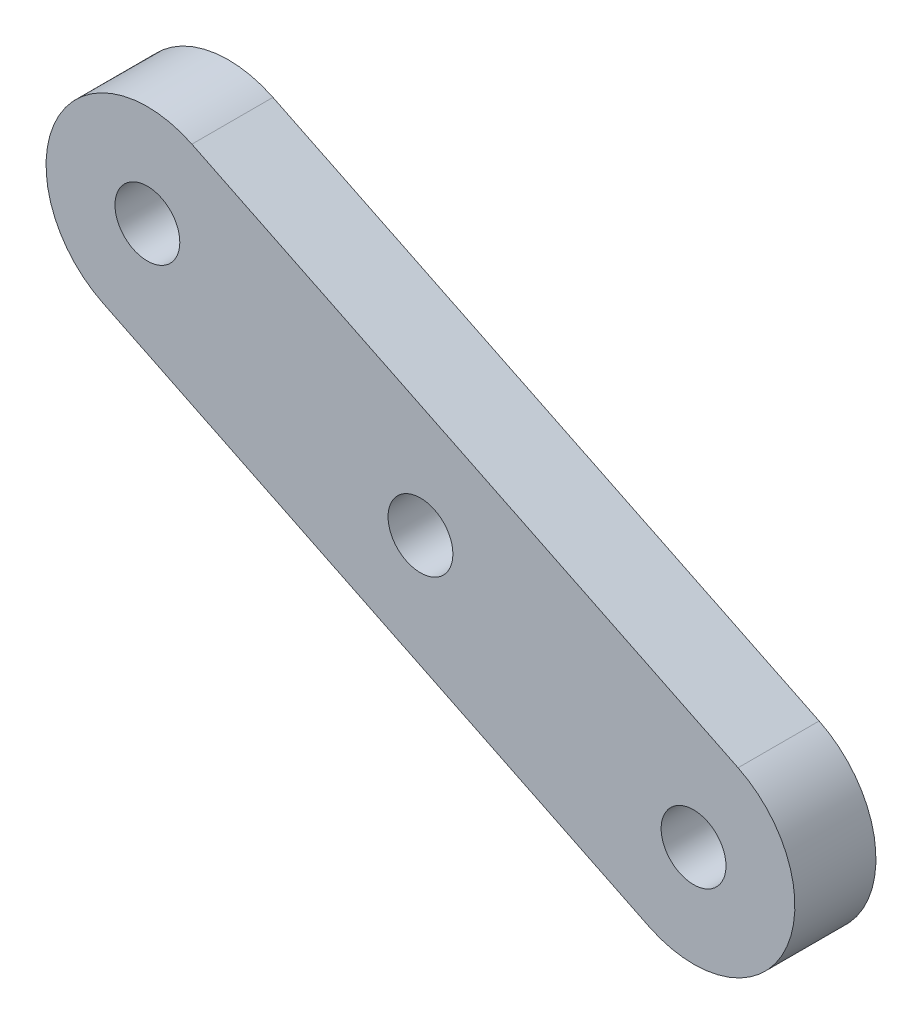
ISO-10303-21;
HEADER;
FILE_DESCRIPTION(('STEP AP214'),'2;1');
FILE_NAME('part.step','',(''),(''),'','','');
FILE_SCHEMA(('AUTOMOTIVE_DESIGN { 1 0 10303 214 1 1 1 1 }'));
ENDSEC;
DATA;
#1=APPLICATION_CONTEXT('core data for automotive mechanical design processes');
#2=APPLICATION_PROTOCOL_DEFINITION('international standard','automotive_design',2000,#1);
#3=PRODUCT_CONTEXT('',#1,'mechanical');
#4=PRODUCT('Part','Part','',(#3));
#5=PRODUCT_RELATED_PRODUCT_CATEGORY('part','',(#4));
#6=PRODUCT_DEFINITION_FORMATION('','',#4);
#7=PRODUCT_DEFINITION_CONTEXT('part definition',#1,'design');
#8=PRODUCT_DEFINITION('design','',#6,#7);
#9=PRODUCT_DEFINITION_SHAPE('','',#8);
#10=(LENGTH_UNIT() NAMED_UNIT(*) SI_UNIT(.MILLI.,.METRE.));
#11=(NAMED_UNIT(*) PLANE_ANGLE_UNIT() SI_UNIT($,.RADIAN.));
#12=(NAMED_UNIT(*) SI_UNIT($,.STERADIAN.) SOLID_ANGLE_UNIT());
#13=UNCERTAINTY_MEASURE_WITH_UNIT(LENGTH_MEASURE(1.E-05),#10,'distance_accuracy_value','');
#14=(GEOMETRIC_REPRESENTATION_CONTEXT(3) GLOBAL_UNCERTAINTY_ASSIGNED_CONTEXT((#13)) GLOBAL_UNIT_ASSIGNED_CONTEXT((#10,
#11,#12)) REPRESENTATION_CONTEXT('',''));
#15=CARTESIAN_POINT('',(0.,0.,0.));
#16=DIRECTION('',(0.,0.,1.));
#17=DIRECTION('',(1.,0.,0.));
#18=AXIS2_PLACEMENT_3D('',#15,#16,#17);
#19=CARTESIAN_POINT('',(0.,0.,4.));
#20=DIRECTION('',(0.,0.,1.));
#21=DIRECTION('',(1.,0.,0.));
#22=AXIS2_PLACEMENT_3D('',#19,#20,#21);
#23=PLANE('',#22);
#24=CARTESIAN_POINT('',(0.,0.,4.));
#25=DIRECTION('',(0.,0.,1.));
#26=DIRECTION('',(1.,0.,0.));
#27=AXIS2_PLACEMENT_3D('',#24,#25,#26);
#28=CIRCLE('',#27,1.6);
#29=CARTESIAN_POINT('',(1.60000000000001,0.,4.));
#30=VERTEX_POINT('',#29);
#31=EDGE_CURVE('E116',#30,#30,#28,.T.);
#32=ORIENTED_EDGE('',*,*,#31,.F.);
#33=EDGE_LOOP('',(#32));
#34=FACE_BOUND('',#33,.T.);
#35=CARTESIAN_POINT('',(0.,0.,4.));
#36=DIRECTION('',(0.,0.,1.));
#37=DIRECTION('',(1.,0.,0.));
#38=AXIS2_PLACEMENT_3D('',#35,#36,#37);
#39=CIRCLE('',#38,5.);
#40=CARTESIAN_POINT('',(-2.19568936266241,-4.4920984208598,4.));
#41=VERTEX_POINT('',#40);
#42=CARTESIAN_POINT('',(2.19568936266242,4.4920984208598,4.));
#43=VERTEX_POINT('',#42);
#44=EDGE_CURVE('E86',#41,#43,#39,.T.);
#45=ORIENTED_EDGE('',*,*,#44,.T.);
#46=DIRECTION('',(-0.89841968417196,0.439137872532483,0.));
#47=VECTOR('',#46,1.);
#48=CARTESIAN_POINT('',(2.19568936266242,4.4920984208598,4.));
#49=LINE('',#48,#47);
#50=CARTESIAN_POINT('',(-24.7569011624964,17.6662345968343,4.));
#51=VERTEX_POINT('',#50);
#52=EDGE_CURVE('E81',#43,#51,#49,.T.);
#53=ORIENTED_EDGE('',*,*,#52,.T.);
#54=CARTESIAN_POINT('',(-26.9525905251588,13.1741361759745,4.));
#55=DIRECTION('',(0.,0.,1.));
#56=DIRECTION('',(1.,0.,0.));
#57=AXIS2_PLACEMENT_3D('',#54,#55,#56);
#58=CIRCLE('',#57,5.);
#59=CARTESIAN_POINT('',(-29.1482798878212,8.68203775511468,4.));
#60=VERTEX_POINT('',#59);
#61=EDGE_CURVE('E84',#51,#60,#58,.T.);
#62=ORIENTED_EDGE('',*,*,#61,.T.);
#63=DIRECTION('',(0.89841968417196,-0.439137872532483,0.));
#64=VECTOR('',#63,1.);
#65=CARTESIAN_POINT('',(-2.19568936266241,-4.4920984208598,4.));
#66=LINE('',#65,#64);
#67=EDGE_CURVE('E51',#60,#41,#66,.T.);
#68=ORIENTED_EDGE('',*,*,#67,.T.);
#69=EDGE_LOOP('',(#45,#53,#62,#68));
#70=FACE_BOUND('',#69,.T.);
#71=CARTESIAN_POINT('',(-26.9525905251588,13.1741361759745,4.));
#72=DIRECTION('',(0.,0.,1.));
#73=DIRECTION('',(1.,0.,0.));
#74=AXIS2_PLACEMENT_3D('',#71,#72,#73);
#75=CIRCLE('',#74,1.6);
#76=CARTESIAN_POINT('',(-25.3525905251588,13.1741361759745,4.));
#77=VERTEX_POINT('',#76);
#78=EDGE_CURVE('E101',#77,#77,#75,.T.);
#79=ORIENTED_EDGE('',*,*,#78,.F.);
#80=EDGE_LOOP('',(#79));
#81=FACE_BOUND('',#80,.T.);
#82=CARTESIAN_POINT('',(-13.4762952625794,6.58706808798724,4.));
#83=DIRECTION('',(0.,0.,1.));
#84=DIRECTION('',(1.,0.,0.));
#85=AXIS2_PLACEMENT_3D('',#82,#83,#84);
#86=CIRCLE('',#85,1.6);
#87=CARTESIAN_POINT('',(-11.8762952625794,6.58706808798724,4.));
#88=VERTEX_POINT('',#87);
#89=EDGE_CURVE('E122',#88,#88,#86,.T.);
#90=ORIENTED_EDGE('',*,*,#89,.F.);
#91=EDGE_LOOP('',(#90));
#92=FACE_BOUND('',#91,.T.);
#93=ADVANCED_FACE('F34',(#34,#70,#81,#92),#23,.T.);
#94=CARTESIAN_POINT('',(0.,0.,0.));
#95=DIRECTION('',(0.,0.,1.));
#96=DIRECTION('',(1.,0.,0.));
#97=AXIS2_PLACEMENT_3D('',#94,#95,#96);
#98=PLANE('',#97);
#99=CARTESIAN_POINT('',(0.,0.,0.));
#100=DIRECTION('',(0.,0.,1.));
#101=DIRECTION('',(1.,0.,0.));
#102=AXIS2_PLACEMENT_3D('',#99,#100,#101);
#103=CIRCLE('',#102,5.);
#104=CARTESIAN_POINT('',(-2.19568936266241,-4.4920984208598,0.));
#105=VERTEX_POINT('',#104);
#106=CARTESIAN_POINT('',(2.19568936266242,4.4920984208598,0.));
#107=VERTEX_POINT('',#106);
#108=EDGE_CURVE('E98',#105,#107,#103,.T.);
#109=ORIENTED_EDGE('',*,*,#108,.F.);
#110=DIRECTION('',(0.89841968417196,-0.439137872532483,0.));
#111=VECTOR('',#110,1.);
#112=CARTESIAN_POINT('',(-2.19568936266241,-4.4920984208598,0.));
#113=LINE('',#112,#111);
#114=CARTESIAN_POINT('',(-29.1482798878212,8.68203775511468,0.));
#115=VERTEX_POINT('',#114);
#116=EDGE_CURVE('E74',#115,#105,#113,.T.);
#117=ORIENTED_EDGE('',*,*,#116,.F.);
#118=CARTESIAN_POINT('',(-26.9525905251588,13.1741361759745,0.));
#119=DIRECTION('',(0.,0.,1.));
#120=DIRECTION('',(1.,0.,0.));
#121=AXIS2_PLACEMENT_3D('',#118,#119,#120);
#122=CIRCLE('',#121,5.);
#123=CARTESIAN_POINT('',(-24.7569011624964,17.6662345968343,0.));
#124=VERTEX_POINT('',#123);
#125=EDGE_CURVE('E68',#124,#115,#122,.T.);
#126=ORIENTED_EDGE('',*,*,#125,.F.);
#127=DIRECTION('',(-0.89841968417196,0.439137872532483,0.));
#128=VECTOR('',#127,1.);
#129=CARTESIAN_POINT('',(2.19568936266242,4.4920984208598,0.));
#130=LINE('',#129,#128);
#131=EDGE_CURVE('E90',#107,#124,#130,.T.);
#132=ORIENTED_EDGE('',*,*,#131,.F.);
#133=EDGE_LOOP('',(#109,#117,#126,#132));
#134=FACE_BOUND('',#133,.T.);
#135=CARTESIAN_POINT('',(-26.9525905251588,13.1741361759745,0.));
#136=DIRECTION('',(0.,0.,1.));
#137=DIRECTION('',(1.,0.,0.));
#138=AXIS2_PLACEMENT_3D('',#135,#136,#137);
#139=CIRCLE('',#138,1.6);
#140=CARTESIAN_POINT('',(-25.3525905251588,13.1741361759745,0.));
#141=VERTEX_POINT('',#140);
#142=EDGE_CURVE('E113',#141,#141,#139,.T.);
#143=ORIENTED_EDGE('',*,*,#142,.T.);
#144=EDGE_LOOP('',(#143));
#145=FACE_BOUND('',#144,.T.);
#146=CARTESIAN_POINT('',(0.,0.,0.));
#147=DIRECTION('',(0.,0.,1.));
#148=DIRECTION('',(1.,0.,0.));
#149=AXIS2_PLACEMENT_3D('',#146,#147,#148);
#150=CIRCLE('',#149,1.6);
#151=CARTESIAN_POINT('',(1.60000000000001,0.,0.));
#152=VERTEX_POINT('',#151);
#153=EDGE_CURVE('E119',#152,#152,#150,.T.);
#154=ORIENTED_EDGE('',*,*,#153,.T.);
#155=EDGE_LOOP('',(#154));
#156=FACE_BOUND('',#155,.T.);
#157=CARTESIAN_POINT('',(-13.4762952625794,6.58706808798724,0.));
#158=DIRECTION('',(0.,0.,1.));
#159=DIRECTION('',(1.,0.,0.));
#160=AXIS2_PLACEMENT_3D('',#157,#158,#159);
#161=CIRCLE('',#160,1.6);
#162=CARTESIAN_POINT('',(-11.8762952625794,6.58706808798724,0.));
#163=VERTEX_POINT('',#162);
#164=EDGE_CURVE('E125',#163,#163,#161,.T.);
#165=ORIENTED_EDGE('',*,*,#164,.T.);
#166=EDGE_LOOP('',(#165));
#167=FACE_BOUND('',#166,.T.);
#168=ADVANCED_FACE('F109',(#134,#145,#156,#167),#98,.F.);
#169=CARTESIAN_POINT('',(0.,0.,4.));
#170=DIRECTION('',(0.,0.,-1.));
#171=DIRECTION('',(-1.,0.,0.));
#172=AXIS2_PLACEMENT_3D('',#169,#170,#171);
#173=CYLINDRICAL_SURFACE('',#172,5.);
#174=ORIENTED_EDGE('',*,*,#108,.T.);
#175=DIRECTION('',(0.,0.,-1.));
#176=VECTOR('',#175,1.);
#177=CARTESIAN_POINT('',(2.19568936266242,4.4920984208598,4.));
#178=LINE('',#177,#176);
#179=EDGE_CURVE('E11',#43,#107,#178,.T.);
#180=ORIENTED_EDGE('',*,*,#179,.F.);
#181=ORIENTED_EDGE('',*,*,#44,.F.);
#182=DIRECTION('',(0.,0.,-1.));
#183=VECTOR('',#182,1.);
#184=CARTESIAN_POINT('',(-2.19568936266241,-4.4920984208598,4.));
#185=LINE('',#184,#183);
#186=EDGE_CURVE('E94',#41,#105,#185,.T.);
#187=ORIENTED_EDGE('',*,*,#186,.T.);
#188=EDGE_LOOP('',(#174,#180,#181,#187));
#189=FACE_BOUND('',#188,.T.);
#190=ADVANCED_FACE('F36',(#189),#173,.T.);
#191=CARTESIAN_POINT('',(2.19568936266242,4.4920984208598,4.));
#192=DIRECTION('',(-0.439137872532483,-0.89841968417196,0.));
#193=DIRECTION('',(0.89841968417196,-0.439137872532483,0.));
#194=AXIS2_PLACEMENT_3D('',#191,#192,#193);
#195=PLANE('',#194);
#196=ORIENTED_EDGE('',*,*,#131,.T.);
#197=DIRECTION('',(0.,0.,-1.));
#198=VECTOR('',#197,1.);
#199=CARTESIAN_POINT('',(-24.7569011624964,17.6662345968343,4.));
#200=LINE('',#199,#198);
#201=EDGE_CURVE('E43',#51,#124,#200,.T.);
#202=ORIENTED_EDGE('',*,*,#201,.F.);
#203=ORIENTED_EDGE('',*,*,#52,.F.);
#204=ORIENTED_EDGE('',*,*,#179,.T.);
#205=EDGE_LOOP('',(#196,#202,#203,#204));
#206=FACE_BOUND('',#205,.T.);
#207=ADVANCED_FACE('F89',(#206),#195,.F.);
#208=CARTESIAN_POINT('',(-26.9525905251588,13.1741361759745,4.));
#209=DIRECTION('',(0.,0.,-1.));
#210=DIRECTION('',(-1.,0.,0.));
#211=AXIS2_PLACEMENT_3D('',#208,#209,#210);
#212=CYLINDRICAL_SURFACE('',#211,5.);
#213=ORIENTED_EDGE('',*,*,#125,.T.);
#214=DIRECTION('',(0.,0.,-1.));
#215=VECTOR('',#214,1.);
#216=CARTESIAN_POINT('',(-29.1482798878212,8.68203775511468,4.));
#217=LINE('',#216,#215);
#218=EDGE_CURVE('E91',#60,#115,#217,.T.);
#219=ORIENTED_EDGE('',*,*,#218,.F.);
#220=ORIENTED_EDGE('',*,*,#61,.F.);
#221=ORIENTED_EDGE('',*,*,#201,.T.);
#222=EDGE_LOOP('',(#213,#219,#220,#221));
#223=FACE_BOUND('',#222,.T.);
#224=ADVANCED_FACE('F92',(#223),#212,.T.);
#225=CARTESIAN_POINT('',(-2.19568936266241,-4.4920984208598,4.));
#226=DIRECTION('',(0.439137872532483,0.89841968417196,0.));
#227=DIRECTION('',(-0.89841968417196,0.439137872532483,0.));
#228=AXIS2_PLACEMENT_3D('',#225,#226,#227);
#229=PLANE('',#228);
#230=ORIENTED_EDGE('',*,*,#116,.T.);
#231=ORIENTED_EDGE('',*,*,#186,.F.);
#232=ORIENTED_EDGE('',*,*,#67,.F.);
#233=ORIENTED_EDGE('',*,*,#218,.T.);
#234=EDGE_LOOP('',(#230,#231,#232,#233));
#235=FACE_BOUND('',#234,.T.);
#236=ADVANCED_FACE('F106',(#235),#229,.F.);
#237=CARTESIAN_POINT('',(-26.9525905251588,13.1741361759745,4.));
#238=DIRECTION('',(0.,0.,-1.));
#239=DIRECTION('',(-1.,0.,0.));
#240=AXIS2_PLACEMENT_3D('',#237,#238,#239);
#241=CYLINDRICAL_SURFACE('',#240,1.6);
#242=ORIENTED_EDGE('',*,*,#78,.T.);
#243=EDGE_LOOP('',(#242));
#244=FACE_BOUND('',#243,.T.);
#245=ORIENTED_EDGE('',*,*,#142,.F.);
#246=EDGE_LOOP('',(#245));
#247=FACE_BOUND('',#246,.T.);
#248=ADVANCED_FACE('F143',(#244,#247),#241,.F.);
#249=CARTESIAN_POINT('',(0.,0.,4.));
#250=DIRECTION('',(0.,0.,-1.));
#251=DIRECTION('',(-1.,0.,0.));
#252=AXIS2_PLACEMENT_3D('',#249,#250,#251);
#253=CYLINDRICAL_SURFACE('',#252,1.6);
#254=ORIENTED_EDGE('',*,*,#31,.T.);
#255=EDGE_LOOP('',(#254));
#256=FACE_BOUND('',#255,.T.);
#257=ORIENTED_EDGE('',*,*,#153,.F.);
#258=EDGE_LOOP('',(#257));
#259=FACE_BOUND('',#258,.T.);
#260=ADVANCED_FACE('F189',(#256,#259),#253,.F.);
#261=CARTESIAN_POINT('',(-13.4762952625794,6.58706808798724,4.));
#262=DIRECTION('',(0.,0.,-1.));
#263=DIRECTION('',(-1.,0.,0.));
#264=AXIS2_PLACEMENT_3D('',#261,#262,#263);
#265=CYLINDRICAL_SURFACE('',#264,1.6);
#266=ORIENTED_EDGE('',*,*,#89,.T.);
#267=EDGE_LOOP('',(#266));
#268=FACE_BOUND('',#267,.T.);
#269=ORIENTED_EDGE('',*,*,#164,.F.);
#270=EDGE_LOOP('',(#269));
#271=FACE_BOUND('',#270,.T.);
#272=ADVANCED_FACE('F131',(#268,#271),#265,.F.);
#273=CLOSED_SHELL('',(#93,#168,#190,#207,#224,#236,#248,#260,#272));
#274=MANIFOLD_SOLID_BREP('B2',#273);
#275=ADVANCED_BREP_SHAPE_REPRESENTATION('',(#18,#274),#14);
#276=SHAPE_DEFINITION_REPRESENTATION(#9,#275);
ENDSEC;
END-ISO-10303-21;
